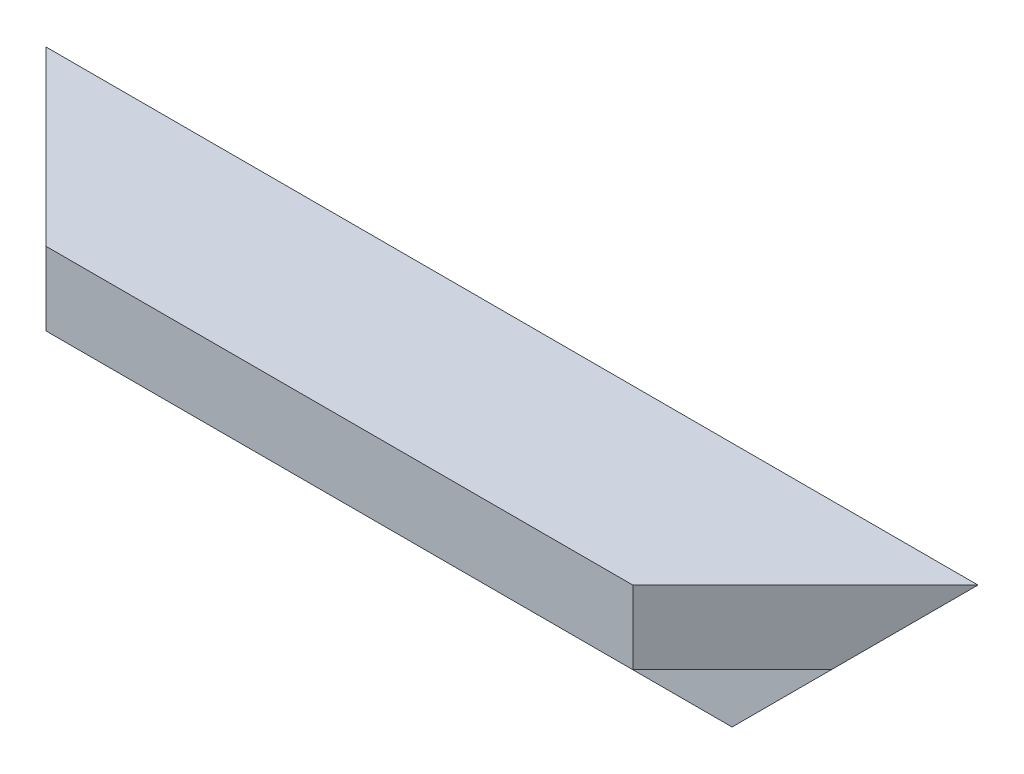
ISO-10303-21;
HEADER;
FILE_DESCRIPTION(('STEP AP214'),'2;1');
FILE_NAME('part.step','',(''),(''),'','','');
FILE_SCHEMA(('AUTOMOTIVE_DESIGN { 1 0 10303 214 1 1 1 1 }'));
ENDSEC;
DATA;
#1=APPLICATION_CONTEXT('core data for automotive mechanical design processes');
#2=APPLICATION_PROTOCOL_DEFINITION('international standard','automotive_design',2000,#1);
#3=PRODUCT_CONTEXT('',#1,'mechanical');
#4=PRODUCT('Part','Part','',(#3));
#5=PRODUCT_RELATED_PRODUCT_CATEGORY('part','',(#4));
#6=PRODUCT_DEFINITION_FORMATION('','',#4);
#7=PRODUCT_DEFINITION_CONTEXT('part definition',#1,'design');
#8=PRODUCT_DEFINITION('design','',#6,#7);
#9=PRODUCT_DEFINITION_SHAPE('','',#8);
#10=(LENGTH_UNIT() NAMED_UNIT(*) SI_UNIT(.MILLI.,.METRE.));
#11=(NAMED_UNIT(*) PLANE_ANGLE_UNIT() SI_UNIT($,.RADIAN.));
#12=(NAMED_UNIT(*) SI_UNIT($,.STERADIAN.) SOLID_ANGLE_UNIT());
#13=UNCERTAINTY_MEASURE_WITH_UNIT(LENGTH_MEASURE(1.E-05),#10,'distance_accuracy_value','');
#14=(GEOMETRIC_REPRESENTATION_CONTEXT(3) GLOBAL_UNCERTAINTY_ASSIGNED_CONTEXT((#13)) GLOBAL_UNIT_ASSIGNED_CONTEXT((#10,
#11,#12)) REPRESENTATION_CONTEXT('',''));
#15=CARTESIAN_POINT('',(0.,0.,0.));
#16=DIRECTION('',(0.,0.,1.));
#17=DIRECTION('',(1.,0.,0.));
#18=AXIS2_PLACEMENT_3D('',#15,#16,#17);
#19=CARTESIAN_POINT('',(216.,-40.,0.));
#20=DIRECTION('',(0.,0.,1.));
#21=DIRECTION('',(1.,0.,0.));
#22=AXIS2_PLACEMENT_3D('',#19,#20,#21);
#23=PLANE('',#22);
#24=DIRECTION('',(-1.,0.,0.));
#25=VECTOR('',#24,1.);
#26=CARTESIAN_POINT('',(216.,0.,0.));
#27=LINE('',#26,#25);
#28=CARTESIAN_POINT('',(216.,0.,0.));
#29=VERTEX_POINT('',#28);
#30=CARTESIAN_POINT('',(0.,0.,0.));
#31=VERTEX_POINT('',#30);
#32=EDGE_CURVE('E102',#29,#31,#27,.T.);
#33=ORIENTED_EDGE('',*,*,#32,.F.);
#34=DIRECTION('',(0.707106781186548,0.707106781186548,0.));
#35=VECTOR('',#34,1.);
#36=CARTESIAN_POINT('',(216.,0.,0.));
#37=LINE('',#36,#35);
#38=CARTESIAN_POINT('',(176.,-40.,0.));
#39=VERTEX_POINT('',#38);
#40=EDGE_CURVE('E87',#39,#29,#37,.T.);
#41=ORIENTED_EDGE('',*,*,#40,.F.);
#42=DIRECTION('',(-1.,0.,0.));
#43=VECTOR('',#42,1.);
#44=CARTESIAN_POINT('',(216.,-40.,0.));
#45=LINE('',#44,#43);
#46=CARTESIAN_POINT('',(40.,-40.,0.));
#47=VERTEX_POINT('',#46);
#48=EDGE_CURVE('E100',#39,#47,#45,.T.);
#49=ORIENTED_EDGE('',*,*,#48,.T.);
#50=DIRECTION('',(0.707106781186548,-0.707106781186548,0.));
#51=VECTOR('',#50,1.);
#52=CARTESIAN_POINT('',(0.,0.,0.));
#53=LINE('',#52,#51);
#54=EDGE_CURVE('E151',#31,#47,#53,.T.);
#55=ORIENTED_EDGE('',*,*,#54,.F.);
#56=EDGE_LOOP('',(#33,#41,#49,#55));
#57=FACE_BOUND('',#56,.T.);
#58=ADVANCED_FACE('F33',(#57),#23,.F.);
#59=CARTESIAN_POINT('',(216.,0.,0.));
#60=DIRECTION('',(0.,-1.,0.));
#61=DIRECTION('',(0.,0.,-1.));
#62=AXIS2_PLACEMENT_3D('',#59,#60,#61);
#63=PLANE('',#62);
#64=DIRECTION('',(-1.,0.,0.));
#65=VECTOR('',#64,1.);
#66=CARTESIAN_POINT('',(216.,0.,40.));
#67=LINE('',#66,#65);
#68=CARTESIAN_POINT('',(176.,0.,40.));
#69=VERTEX_POINT('',#68);
#70=CARTESIAN_POINT('',(40.,0.,40.));
#71=VERTEX_POINT('',#70);
#72=EDGE_CURVE('E121',#69,#71,#67,.T.);
#73=ORIENTED_EDGE('',*,*,#72,.F.);
#74=DIRECTION('',(-0.707106781186548,0.,0.707106781186548));
#75=VECTOR('',#74,1.);
#76=CARTESIAN_POINT('',(216.,0.,0.));
#77=LINE('',#76,#75);
#78=EDGE_CURVE('E126',#29,#69,#77,.T.);
#79=ORIENTED_EDGE('',*,*,#78,.F.);
#80=ORIENTED_EDGE('',*,*,#32,.T.);
#81=DIRECTION('',(-0.707106781186548,0.,-0.707106781186547));
#82=VECTOR('',#81,1.);
#83=CARTESIAN_POINT('',(40.,0.,40.));
#84=LINE('',#83,#82);
#85=EDGE_CURVE('E135',#71,#31,#84,.T.);
#86=ORIENTED_EDGE('',*,*,#85,.F.);
#87=EDGE_LOOP('',(#73,#79,#80,#86));
#88=FACE_BOUND('',#87,.T.);
#89=ADVANCED_FACE('F130',(#88),#63,.F.);
#90=CARTESIAN_POINT('',(216.,0.,40.));
#91=DIRECTION('',(0.,0.,-1.));
#92=DIRECTION('',(-1.,0.,0.));
#93=AXIS2_PLACEMENT_3D('',#90,#91,#92);
#94=PLANE('',#93);
#95=DIRECTION('',(-1.,0.,0.));
#96=VECTOR('',#95,1.);
#97=CARTESIAN_POINT('',(216.,-17.,40.));
#98=LINE('',#97,#96);
#99=CARTESIAN_POINT('',(176.,-17.,40.));
#100=VERTEX_POINT('',#99);
#101=CARTESIAN_POINT('',(40.,-17.,40.));
#102=VERTEX_POINT('',#101);
#103=EDGE_CURVE('E118',#100,#102,#98,.T.);
#104=ORIENTED_EDGE('',*,*,#103,.F.);
#105=DIRECTION('',(0.,1.,0.));
#106=VECTOR('',#105,1.);
#107=CARTESIAN_POINT('',(176.,-40.,40.));
#108=LINE('',#107,#106);
#109=EDGE_CURVE('E47',#100,#69,#108,.T.);
#110=ORIENTED_EDGE('',*,*,#109,.T.);
#111=ORIENTED_EDGE('',*,*,#72,.T.);
#112=DIRECTION('',(0.,1.,0.));
#113=VECTOR('',#112,1.);
#114=CARTESIAN_POINT('',(40.,-40.,40.));
#115=LINE('',#114,#113);
#116=EDGE_CURVE('E132',#102,#71,#115,.T.);
#117=ORIENTED_EDGE('',*,*,#116,.F.);
#118=EDGE_LOOP('',(#104,#110,#111,#117));
#119=FACE_BOUND('',#118,.T.);
#120=ADVANCED_FACE('F155',(#119),#94,.F.);
#121=CARTESIAN_POINT('',(216.,-17.,40.));
#122=DIRECTION('',(0.,1.,0.));
#123=DIRECTION('',(0.,0.,1.));
#124=AXIS2_PLACEMENT_3D('',#121,#122,#123);
#125=PLANE('',#124);
#126=DIRECTION('',(-1.,0.,0.));
#127=VECTOR('',#126,1.);
#128=CARTESIAN_POINT('',(216.,-17.,17.));
#129=LINE('',#128,#127);
#130=CARTESIAN_POINT('',(199.,-17.,17.));
#131=VERTEX_POINT('',#130);
#132=CARTESIAN_POINT('',(17.,-17.,17.));
#133=VERTEX_POINT('',#132);
#134=EDGE_CURVE('E110',#131,#133,#129,.T.);
#135=ORIENTED_EDGE('',*,*,#134,.F.);
#136=DIRECTION('',(-0.707106781186548,0.,0.707106781186548));
#137=VECTOR('',#136,1.);
#138=CARTESIAN_POINT('',(196.,-17.,20.));
#139=LINE('',#138,#137);
#140=EDGE_CURVE('E108',#131,#100,#139,.T.);
#141=ORIENTED_EDGE('',*,*,#140,.T.);
#142=ORIENTED_EDGE('',*,*,#103,.T.);
#143=DIRECTION('',(-0.707106781186548,0.,-0.707106781186548));
#144=VECTOR('',#143,1.);
#145=CARTESIAN_POINT('',(128.,-17.,128.));
#146=LINE('',#145,#144);
#147=EDGE_CURVE('E112',#102,#133,#146,.T.);
#148=ORIENTED_EDGE('',*,*,#147,.T.);
#149=EDGE_LOOP('',(#135,#141,#142,#148));
#150=FACE_BOUND('',#149,.T.);
#151=ADVANCED_FACE('F143',(#150),#125,.F.);
#152=CARTESIAN_POINT('',(216.,-17.,17.));
#153=DIRECTION('',(0.,0.,-1.));
#154=DIRECTION('',(0.,1.,0.));
#155=AXIS2_PLACEMENT_3D('',#152,#153,#154);
#156=PLANE('',#155);
#157=DIRECTION('',(-1.,0.,0.));
#158=VECTOR('',#157,1.);
#159=CARTESIAN_POINT('',(216.,-40.,17.));
#160=LINE('',#159,#158);
#161=CARTESIAN_POINT('',(176.,-40.,17.));
#162=VERTEX_POINT('',#161);
#163=CARTESIAN_POINT('',(40.,-40.,17.));
#164=VERTEX_POINT('',#163);
#165=EDGE_CURVE('E107',#162,#164,#160,.T.);
#166=ORIENTED_EDGE('',*,*,#165,.F.);
#167=DIRECTION('',(0.707106781186548,0.707106781186548,0.));
#168=VECTOR('',#167,1.);
#169=CARTESIAN_POINT('',(207.5,-8.5,17.));
#170=LINE('',#169,#168);
#171=EDGE_CURVE('E90',#162,#131,#170,.T.);
#172=ORIENTED_EDGE('',*,*,#171,.T.);
#173=ORIENTED_EDGE('',*,*,#134,.T.);
#174=DIRECTION('',(0.707106781186548,-0.707106781186548,0.));
#175=VECTOR('',#174,1.);
#176=CARTESIAN_POINT('',(116.5,-116.5,17.));
#177=LINE('',#176,#175);
#178=EDGE_CURVE('E55',#133,#164,#177,.T.);
#179=ORIENTED_EDGE('',*,*,#178,.T.);
#180=EDGE_LOOP('',(#166,#172,#173,#179));
#181=FACE_BOUND('',#180,.T.);
#182=ADVANCED_FACE('F148',(#181),#156,.F.);
#183=CARTESIAN_POINT('',(216.,-40.,17.));
#184=DIRECTION('',(0.,1.,0.));
#185=DIRECTION('',(0.,0.,1.));
#186=AXIS2_PLACEMENT_3D('',#183,#184,#185);
#187=PLANE('',#186);
#188=ORIENTED_EDGE('',*,*,#48,.F.);
#189=DIRECTION('',(0.,0.,-1.));
#190=VECTOR('',#189,1.);
#191=CARTESIAN_POINT('',(176.,-40.,40.));
#192=LINE('',#191,#190);
#193=EDGE_CURVE('E84',#162,#39,#192,.T.);
#194=ORIENTED_EDGE('',*,*,#193,.F.);
#195=ORIENTED_EDGE('',*,*,#165,.T.);
#196=DIRECTION('',(0.,0.,-1.));
#197=VECTOR('',#196,1.);
#198=CARTESIAN_POINT('',(40.,-40.,40.));
#199=LINE('',#198,#197);
#200=EDGE_CURVE('E103',#164,#47,#199,.T.);
#201=ORIENTED_EDGE('',*,*,#200,.T.);
#202=EDGE_LOOP('',(#188,#194,#195,#201));
#203=FACE_BOUND('',#202,.T.);
#204=ADVANCED_FACE('F106',(#203),#187,.F.);
#205=CARTESIAN_POINT('',(40.,-40.,40.));
#206=DIRECTION('',(0.707106781186548,0.,-0.707106781186548));
#207=DIRECTION('',(-0.707106781186548,0.,-0.707106781186548));
#208=AXIS2_PLACEMENT_3D('',#205,#206,#207);
#209=PLANE('',#208);
#210=ORIENTED_EDGE('',*,*,#85,.T.);
#211=DIRECTION('',(0.577350269189626,-0.577350269189626,0.577350269189626));
#212=VECTOR('',#211,1.);
#213=CARTESIAN_POINT('',(40.,-40.,40.));
#214=LINE('',#213,#212);
#215=EDGE_CURVE('E11',#31,#133,#214,.T.);
#216=ORIENTED_EDGE('',*,*,#215,.T.);
#217=ORIENTED_EDGE('',*,*,#147,.F.);
#218=ORIENTED_EDGE('',*,*,#116,.T.);
#219=EDGE_LOOP('',(#210,#216,#217,#218));
#220=FACE_BOUND('',#219,.T.);
#221=ADVANCED_FACE('F153',(#220),#209,.F.);
#222=CARTESIAN_POINT('',(216.,-40.,0.));
#223=DIRECTION('',(-0.707106781186548,0.,-0.707106781186548));
#224=DIRECTION('',(-0.707106781186548,0.,0.707106781186548));
#225=AXIS2_PLACEMENT_3D('',#222,#223,#224);
#226=PLANE('',#225);
#227=ORIENTED_EDGE('',*,*,#140,.F.);
#228=DIRECTION('',(0.577350269189626,0.577350269189626,-0.577350269189626));
#229=VECTOR('',#228,1.);
#230=CARTESIAN_POINT('',(202.666666666667,-13.3333333333333,13.3333333333333));
#231=LINE('',#230,#229);
#232=EDGE_CURVE('E40',#131,#29,#231,.T.);
#233=ORIENTED_EDGE('',*,*,#232,.T.);
#234=ORIENTED_EDGE('',*,*,#78,.T.);
#235=ORIENTED_EDGE('',*,*,#109,.F.);
#236=EDGE_LOOP('',(#227,#233,#234,#235));
#237=FACE_BOUND('',#236,.T.);
#238=ADVANCED_FACE('F125',(#237),#226,.F.);
#239=CARTESIAN_POINT('',(216.,0.,40.));
#240=DIRECTION('',(-0.707106781186548,0.707106781186548,0.));
#241=DIRECTION('',(-0.707106781186548,-0.707106781186548,0.));
#242=AXIS2_PLACEMENT_3D('',#239,#240,#241);
#243=PLANE('',#242);
#244=ORIENTED_EDGE('',*,*,#193,.T.);
#245=ORIENTED_EDGE('',*,*,#40,.T.);
#246=ORIENTED_EDGE('',*,*,#232,.F.);
#247=ORIENTED_EDGE('',*,*,#171,.F.);
#248=EDGE_LOOP('',(#244,#245,#246,#247));
#249=FACE_BOUND('',#248,.T.);
#250=ADVANCED_FACE('F86',(#249),#243,.F.);
#251=CARTESIAN_POINT('',(0.,0.,40.));
#252=DIRECTION('',(0.707106781186548,0.707106781186548,0.));
#253=DIRECTION('',(-0.707106781186548,0.707106781186548,0.));
#254=AXIS2_PLACEMENT_3D('',#251,#252,#253);
#255=PLANE('',#254);
#256=ORIENTED_EDGE('',*,*,#215,.F.);
#257=ORIENTED_EDGE('',*,*,#54,.T.);
#258=ORIENTED_EDGE('',*,*,#200,.F.);
#259=ORIENTED_EDGE('',*,*,#178,.F.);
#260=EDGE_LOOP('',(#256,#257,#258,#259));
#261=FACE_BOUND('',#260,.T.);
#262=ADVANCED_FACE('F152',(#261),#255,.F.);
#263=CLOSED_SHELL('',(#58,#89,#120,#151,#182,#204,#221,#238,#250,#262));
#264=MANIFOLD_SOLID_BREP('B2',#263);
#265=ADVANCED_BREP_SHAPE_REPRESENTATION('',(#18,#264),#14);
#266=SHAPE_DEFINITION_REPRESENTATION(#9,#265);
ENDSEC;
END-ISO-10303-21;
